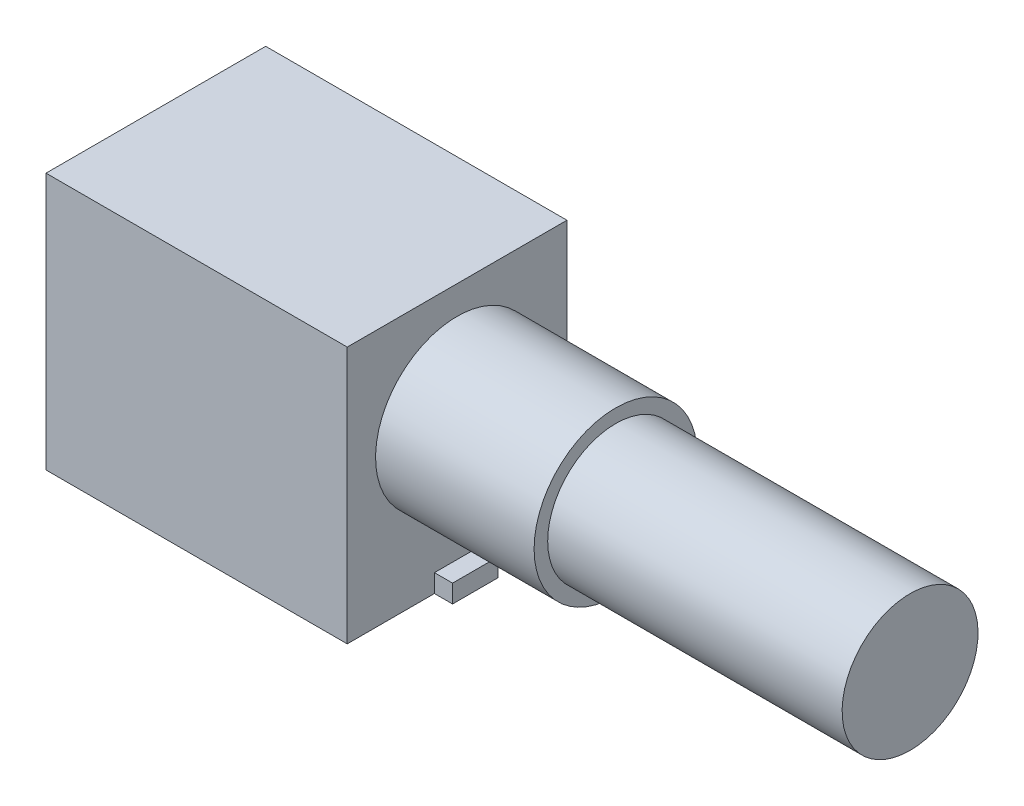
ISO-10303-21;
HEADER;
FILE_DESCRIPTION(('STEP AP214'),'2;1');
FILE_NAME('part.step','',(''),(''),'','','');
FILE_SCHEMA(('AUTOMOTIVE_DESIGN { 1 0 10303 214 1 1 1 1 }'));
ENDSEC;
DATA;
#1=APPLICATION_CONTEXT('core data for automotive mechanical design processes');
#2=APPLICATION_PROTOCOL_DEFINITION('international standard','automotive_design',2000,#1);
#3=PRODUCT_CONTEXT('',#1,'mechanical');
#4=PRODUCT('Part','Part','',(#3));
#5=PRODUCT_RELATED_PRODUCT_CATEGORY('part','',(#4));
#6=PRODUCT_DEFINITION_FORMATION('','',#4);
#7=PRODUCT_DEFINITION_CONTEXT('part definition',#1,'design');
#8=PRODUCT_DEFINITION('design','',#6,#7);
#9=PRODUCT_DEFINITION_SHAPE('','',#8);
#10=(LENGTH_UNIT() NAMED_UNIT(*) SI_UNIT(.MILLI.,.METRE.));
#11=(NAMED_UNIT(*) PLANE_ANGLE_UNIT() SI_UNIT($,.RADIAN.));
#12=(NAMED_UNIT(*) SI_UNIT($,.STERADIAN.) SOLID_ANGLE_UNIT());
#13=UNCERTAINTY_MEASURE_WITH_UNIT(LENGTH_MEASURE(1.E-05),#10,'distance_accuracy_value','');
#14=(GEOMETRIC_REPRESENTATION_CONTEXT(3) GLOBAL_UNCERTAINTY_ASSIGNED_CONTEXT((#13)) GLOBAL_UNIT_ASSIGNED_CONTEXT((#10,
#11,#12)) REPRESENTATION_CONTEXT('',''));
#15=CARTESIAN_POINT('',(0.,0.,0.));
#16=DIRECTION('',(0.,0.,1.));
#17=DIRECTION('',(1.,0.,0.));
#18=AXIS2_PLACEMENT_3D('',#15,#16,#17);
#19=CARTESIAN_POINT('',(13.3,0.,9.7));
#20=DIRECTION('',(-1.,0.,0.));
#21=DIRECTION('',(0.,-1.,0.));
#22=AXIS2_PLACEMENT_3D('',#19,#20,#21);
#23=PLANE('',#22);
#24=CARTESIAN_POINT('',(13.3,6.5,4.85));
#25=DIRECTION('',(-1.,0.,0.));
#26=DIRECTION('',(0.,-1.,0.));
#27=AXIS2_PLACEMENT_3D('',#24,#25,#26);
#28=CIRCLE('',#27,3.6);
#29=CARTESIAN_POINT('',(13.3,2.9,4.85));
#30=VERTEX_POINT('',#29);
#31=EDGE_CURVE('E12',#30,#30,#28,.F.);
#32=ORIENTED_EDGE('',*,*,#31,.F.);
#33=EDGE_LOOP('',(#32));
#34=FACE_BOUND('',#33,.T.);
#35=DIRECTION('',(0.,-1.,0.));
#36=VECTOR('',#35,1.);
#37=CARTESIAN_POINT('',(13.3,0.,5.85));
#38=LINE('',#37,#36);
#39=CARTESIAN_POINT('',(13.3,0.800000000000002,5.85));
#40=VERTEX_POINT('',#39);
#41=CARTESIAN_POINT('',(13.3,0.,5.85));
#42=VERTEX_POINT('',#41);
#43=EDGE_CURVE('E50',#40,#42,#38,.T.);
#44=ORIENTED_EDGE('',*,*,#43,.F.);
#45=DIRECTION('',(0.,0.,1.));
#46=VECTOR('',#45,1.);
#47=CARTESIAN_POINT('',(13.3,0.800000000000002,5.85));
#48=LINE('',#47,#46);
#49=CARTESIAN_POINT('',(13.3,0.800000000000002,3.85));
#50=VERTEX_POINT('',#49);
#51=EDGE_CURVE('E54',#50,#40,#48,.T.);
#52=ORIENTED_EDGE('',*,*,#51,.F.);
#53=DIRECTION('',(0.,1.,0.));
#54=VECTOR('',#53,1.);
#55=CARTESIAN_POINT('',(13.3,0.,3.85));
#56=LINE('',#55,#54);
#57=CARTESIAN_POINT('',(13.3,0.,3.85));
#58=VERTEX_POINT('',#57);
#59=EDGE_CURVE('E314',#58,#50,#56,.T.);
#60=ORIENTED_EDGE('',*,*,#59,.F.);
#61=DIRECTION('',(0.,0.,-1.));
#62=VECTOR('',#61,1.);
#63=CARTESIAN_POINT('',(13.3,0.,9.7));
#64=LINE('',#63,#62);
#65=CARTESIAN_POINT('',(13.3,0.,0.));
#66=VERTEX_POINT('',#65);
#67=EDGE_CURVE('E160',#58,#66,#64,.T.);
#68=ORIENTED_EDGE('',*,*,#67,.T.);
#69=DIRECTION('',(0.,1.,0.));
#70=VECTOR('',#69,1.);
#71=CARTESIAN_POINT('',(13.3,0.,0.));
#72=LINE('',#71,#70);
#73=CARTESIAN_POINT('',(13.3,11.35,0.));
#74=VERTEX_POINT('',#73);
#75=EDGE_CURVE('E152',#66,#74,#72,.T.);
#76=ORIENTED_EDGE('',*,*,#75,.T.);
#77=DIRECTION('',(0.,0.,-1.));
#78=VECTOR('',#77,1.);
#79=CARTESIAN_POINT('',(13.3,11.35,9.7));
#80=LINE('',#79,#78);
#81=CARTESIAN_POINT('',(13.3,11.35,9.7));
#82=VERTEX_POINT('',#81);
#83=EDGE_CURVE('E157',#82,#74,#80,.T.);
#84=ORIENTED_EDGE('',*,*,#83,.F.);
#85=DIRECTION('',(0.,1.,0.));
#86=VECTOR('',#85,1.);
#87=CARTESIAN_POINT('',(13.3,0.,9.7));
#88=LINE('',#87,#86);
#89=CARTESIAN_POINT('',(13.3,0.,9.7));
#90=VERTEX_POINT('',#89);
#91=EDGE_CURVE('E143',#90,#82,#88,.T.);
#92=ORIENTED_EDGE('',*,*,#91,.F.);
#93=EDGE_CURVE('E161',#90,#42,#64,.T.);
#94=ORIENTED_EDGE('',*,*,#93,.T.);
#95=EDGE_LOOP('',(#44,#52,#60,#68,#76,#84,#92,#94));
#96=FACE_BOUND('',#95,.T.);
#97=ADVANCED_FACE('F35',(#34,#96),#23,.F.);
#98=CARTESIAN_POINT('',(20.3,6.5,4.85));
#99=DIRECTION('',(1.,0.,0.));
#100=DIRECTION('',(0.,1.,0.));
#101=AXIS2_PLACEMENT_3D('',#98,#99,#100);
#102=PLANE('',#101);
#103=CARTESIAN_POINT('',(20.3,6.5,4.85));
#104=DIRECTION('',(1.,0.,0.));
#105=DIRECTION('',(0.,1.,0.));
#106=AXIS2_PLACEMENT_3D('',#103,#104,#105);
#107=CIRCLE('',#106,3.6);
#108=CARTESIAN_POINT('',(20.3,10.1,4.85));
#109=VERTEX_POINT('',#108);
#110=EDGE_CURVE('E133',#109,#109,#107,.T.);
#111=ORIENTED_EDGE('',*,*,#110,.T.);
#112=EDGE_LOOP('',(#111));
#113=FACE_BOUND('',#112,.T.);
#114=CARTESIAN_POINT('',(20.3,6.5,4.85));
#115=DIRECTION('',(1.,0.,0.));
#116=DIRECTION('',(0.,1.,0.));
#117=AXIS2_PLACEMENT_3D('',#114,#115,#116);
#118=CIRCLE('',#117,3.);
#119=CARTESIAN_POINT('',(20.3,9.5,4.85));
#120=VERTEX_POINT('',#119);
#121=EDGE_CURVE('E122',#120,#120,#118,.T.);
#122=ORIENTED_EDGE('',*,*,#121,.F.);
#123=EDGE_LOOP('',(#122));
#124=FACE_BOUND('',#123,.T.);
#125=ADVANCED_FACE('F190',(#113,#124),#102,.T.);
#126=CARTESIAN_POINT('',(0.,0.,9.7));
#127=DIRECTION('',(1.,0.,0.));
#128=DIRECTION('',(0.,0.,-1.));
#129=AXIS2_PLACEMENT_3D('',#126,#127,#128);
#130=PLANE('',#129);
#131=DIRECTION('',(0.,-1.,0.));
#132=VECTOR('',#131,1.);
#133=CARTESIAN_POINT('',(0.,0.,0.));
#134=LINE('',#133,#132);
#135=CARTESIAN_POINT('',(0.,11.35,0.));
#136=VERTEX_POINT('',#135);
#137=CARTESIAN_POINT('',(0.,0.,0.));
#138=VERTEX_POINT('',#137);
#139=EDGE_CURVE('E136',#136,#138,#134,.T.);
#140=ORIENTED_EDGE('',*,*,#139,.T.);
#141=DIRECTION('',(0.,0.,-1.));
#142=VECTOR('',#141,1.);
#143=CARTESIAN_POINT('',(0.,0.,9.7));
#144=LINE('',#143,#142);
#145=CARTESIAN_POINT('',(0.,0.,9.7));
#146=VERTEX_POINT('',#145);
#147=EDGE_CURVE('E43',#146,#138,#144,.T.);
#148=ORIENTED_EDGE('',*,*,#147,.F.);
#149=DIRECTION('',(0.,-1.,0.));
#150=VECTOR('',#149,1.);
#151=CARTESIAN_POINT('',(0.,0.,9.7));
#152=LINE('',#151,#150);
#153=CARTESIAN_POINT('',(0.,11.35,9.7));
#154=VERTEX_POINT('',#153);
#155=EDGE_CURVE('E137',#154,#146,#152,.T.);
#156=ORIENTED_EDGE('',*,*,#155,.F.);
#157=DIRECTION('',(0.,0.,-1.));
#158=VECTOR('',#157,1.);
#159=CARTESIAN_POINT('',(0.,11.35,9.7));
#160=LINE('',#159,#158);
#161=EDGE_CURVE('E147',#154,#136,#160,.T.);
#162=ORIENTED_EDGE('',*,*,#161,.T.);
#163=EDGE_LOOP('',(#140,#148,#156,#162));
#164=FACE_BOUND('',#163,.T.);
#165=ADVANCED_FACE('F37',(#164),#130,.F.);
#166=CARTESIAN_POINT('',(0.,0.,9.7));
#167=DIRECTION('',(0.,1.,0.));
#168=DIRECTION('',(0.,0.,1.));
#169=AXIS2_PLACEMENT_3D('',#166,#167,#168);
#170=PLANE('',#169);
#171=DIRECTION('',(1.,0.,0.));
#172=VECTOR('',#171,1.);
#173=CARTESIAN_POINT('',(0.,0.,0.));
#174=LINE('',#173,#172);
#175=EDGE_CURVE('E150',#138,#66,#174,.T.);
#176=ORIENTED_EDGE('',*,*,#175,.T.);
#177=ORIENTED_EDGE('',*,*,#67,.F.);
#178=DIRECTION('',(-1.,0.,0.));
#179=VECTOR('',#178,1.);
#180=CARTESIAN_POINT('',(14.1,0.,3.85));
#181=LINE('',#180,#179);
#182=CARTESIAN_POINT('',(14.1,0.,3.85));
#183=VERTEX_POINT('',#182);
#184=EDGE_CURVE('E107',#183,#58,#181,.T.);
#185=ORIENTED_EDGE('',*,*,#184,.F.);
#186=DIRECTION('',(0.,0.,-1.));
#187=VECTOR('',#186,1.);
#188=CARTESIAN_POINT('',(14.1,0.,5.85));
#189=LINE('',#188,#187);
#190=CARTESIAN_POINT('',(14.1,0.,5.85));
#191=VERTEX_POINT('',#190);
#192=EDGE_CURVE('E99',#191,#183,#189,.T.);
#193=ORIENTED_EDGE('',*,*,#192,.F.);
#194=DIRECTION('',(-1.,0.,0.));
#195=VECTOR('',#194,1.);
#196=CARTESIAN_POINT('',(14.1,0.,5.85));
#197=LINE('',#196,#195);
#198=EDGE_CURVE('E105',#191,#42,#197,.T.);
#199=ORIENTED_EDGE('',*,*,#198,.T.);
#200=ORIENTED_EDGE('',*,*,#93,.F.);
#201=DIRECTION('',(1.,0.,0.));
#202=VECTOR('',#201,1.);
#203=CARTESIAN_POINT('',(0.,0.,9.7));
#204=LINE('',#203,#202);
#205=EDGE_CURVE('E140',#146,#90,#204,.T.);
#206=ORIENTED_EDGE('',*,*,#205,.F.);
#207=ORIENTED_EDGE('',*,*,#147,.T.);
#208=EDGE_LOOP('',(#176,#177,#185,#193,#199,#200,#206,#207));
#209=FACE_BOUND('',#208,.T.);
#210=ADVANCED_FACE('F102',(#209),#170,.F.);
#211=CARTESIAN_POINT('',(0.,11.35,9.7));
#212=DIRECTION('',(0.,-1.,0.));
#213=DIRECTION('',(0.,0.,-1.));
#214=AXIS2_PLACEMENT_3D('',#211,#212,#213);
#215=PLANE('',#214);
#216=DIRECTION('',(-1.,0.,0.));
#217=VECTOR('',#216,1.);
#218=CARTESIAN_POINT('',(0.,11.35,0.));
#219=LINE('',#218,#217);
#220=EDGE_CURVE('E141',#74,#136,#219,.T.);
#221=ORIENTED_EDGE('',*,*,#220,.T.);
#222=ORIENTED_EDGE('',*,*,#161,.F.);
#223=DIRECTION('',(-1.,0.,0.));
#224=VECTOR('',#223,1.);
#225=CARTESIAN_POINT('',(0.,11.35,9.7));
#226=LINE('',#225,#224);
#227=EDGE_CURVE('E145',#82,#154,#226,.T.);
#228=ORIENTED_EDGE('',*,*,#227,.F.);
#229=ORIENTED_EDGE('',*,*,#83,.T.);
#230=EDGE_LOOP('',(#221,#222,#228,#229));
#231=FACE_BOUND('',#230,.T.);
#232=ADVANCED_FACE('F176',(#231),#215,.F.);
#233=CARTESIAN_POINT('',(0.,0.,9.7));
#234=DIRECTION('',(0.,0.,-1.));
#235=DIRECTION('',(-1.,0.,0.));
#236=AXIS2_PLACEMENT_3D('',#233,#234,#235);
#237=PLANE('',#236);
#238=ORIENTED_EDGE('',*,*,#155,.T.);
#239=ORIENTED_EDGE('',*,*,#205,.T.);
#240=ORIENTED_EDGE('',*,*,#91,.T.);
#241=ORIENTED_EDGE('',*,*,#227,.T.);
#242=EDGE_LOOP('',(#238,#239,#240,#241));
#243=FACE_BOUND('',#242,.T.);
#244=ADVANCED_FACE('F178',(#243),#237,.F.);
#245=CARTESIAN_POINT('',(0.,0.,0.));
#246=DIRECTION('',(0.,0.,-1.));
#247=DIRECTION('',(-1.,0.,0.));
#248=AXIS2_PLACEMENT_3D('',#245,#246,#247);
#249=PLANE('',#248);
#250=ORIENTED_EDGE('',*,*,#139,.F.);
#251=ORIENTED_EDGE('',*,*,#220,.F.);
#252=ORIENTED_EDGE('',*,*,#75,.F.);
#253=ORIENTED_EDGE('',*,*,#175,.F.);
#254=EDGE_LOOP('',(#250,#251,#252,#253));
#255=FACE_BOUND('',#254,.T.);
#256=ADVANCED_FACE('F171',(#255),#249,.T.);
#257=CARTESIAN_POINT('',(20.3,6.5,4.85));
#258=DIRECTION('',(-1.,0.,0.));
#259=DIRECTION('',(0.,-1.,0.));
#260=AXIS2_PLACEMENT_3D('',#257,#258,#259);
#261=CYLINDRICAL_SURFACE('',#260,3.6);
#262=ORIENTED_EDGE('',*,*,#110,.F.);
#263=EDGE_LOOP('',(#262));
#264=FACE_BOUND('',#263,.T.);
#265=ORIENTED_EDGE('',*,*,#31,.T.);
#266=EDGE_LOOP('',(#265));
#267=FACE_BOUND('',#266,.T.);
#268=ADVANCED_FACE('F185',(#264,#267),#261,.T.);
#269=CARTESIAN_POINT('',(61.7852813742386,6.50000000000001,4.85));
#270=DIRECTION('',(-1.,0.,0.));
#271=DIRECTION('',(0.,-1.,0.));
#272=AXIS2_PLACEMENT_3D('',#269,#270,#271);
#273=CYLINDRICAL_SURFACE('',#272,3.);
#274=CARTESIAN_POINT('',(33.3,6.5,4.85));
#275=DIRECTION('',(-1.,0.,0.));
#276=DIRECTION('',(0.,-1.,0.));
#277=AXIS2_PLACEMENT_3D('',#274,#275,#276);
#278=CIRCLE('',#277,3.);
#279=CARTESIAN_POINT('',(33.3,3.5,4.85));
#280=VERTEX_POINT('',#279);
#281=EDGE_CURVE('E125',#280,#280,#278,.T.);
#282=ORIENTED_EDGE('',*,*,#281,.T.);
#283=EDGE_LOOP('',(#282));
#284=FACE_BOUND('',#283,.T.);
#285=ORIENTED_EDGE('',*,*,#121,.T.);
#286=EDGE_LOOP('',(#285));
#287=FACE_BOUND('',#286,.T.);
#288=ADVANCED_FACE('F221',(#284,#287),#273,.T.);
#289=CARTESIAN_POINT('',(33.3,0.,9.7));
#290=DIRECTION('',(-1.,0.,0.));
#291=DIRECTION('',(0.,-1.,0.));
#292=AXIS2_PLACEMENT_3D('',#289,#290,#291);
#293=PLANE('',#292);
#294=ORIENTED_EDGE('',*,*,#281,.F.);
#295=EDGE_LOOP('',(#294));
#296=FACE_BOUND('',#295,.T.);
#297=ADVANCED_FACE('F225',(#296),#293,.F.);
#298=CARTESIAN_POINT('',(14.1,0.,5.85));
#299=DIRECTION('',(0.,0.,-1.));
#300=DIRECTION('',(-1.,0.,0.));
#301=AXIS2_PLACEMENT_3D('',#298,#299,#300);
#302=PLANE('',#301);
#303=ORIENTED_EDGE('',*,*,#43,.T.);
#304=ORIENTED_EDGE('',*,*,#198,.F.);
#305=DIRECTION('',(0.,-1.,0.));
#306=VECTOR('',#305,1.);
#307=CARTESIAN_POINT('',(14.1,0.,5.85));
#308=LINE('',#307,#306);
#309=CARTESIAN_POINT('',(14.1,0.800000000000002,5.85));
#310=VERTEX_POINT('',#309);
#311=EDGE_CURVE('E111',#310,#191,#308,.T.);
#312=ORIENTED_EDGE('',*,*,#311,.F.);
#313=DIRECTION('',(-1.,0.,0.));
#314=VECTOR('',#313,1.);
#315=CARTESIAN_POINT('',(14.1,0.800000000000002,5.85));
#316=LINE('',#315,#314);
#317=EDGE_CURVE('E312',#310,#40,#316,.T.);
#318=ORIENTED_EDGE('',*,*,#317,.T.);
#319=EDGE_LOOP('',(#303,#304,#312,#318));
#320=FACE_BOUND('',#319,.T.);
#321=ADVANCED_FACE('F121',(#320),#302,.F.);
#322=CARTESIAN_POINT('',(14.1,0.,3.85));
#323=DIRECTION('',(0.,0.,1.));
#324=DIRECTION('',(1.,0.,0.));
#325=AXIS2_PLACEMENT_3D('',#322,#323,#324);
#326=PLANE('',#325);
#327=ORIENTED_EDGE('',*,*,#59,.T.);
#328=DIRECTION('',(-1.,0.,0.));
#329=VECTOR('',#328,1.);
#330=CARTESIAN_POINT('',(14.1,0.800000000000002,3.85));
#331=LINE('',#330,#329);
#332=CARTESIAN_POINT('',(14.1,0.800000000000002,3.85));
#333=VERTEX_POINT('',#332);
#334=EDGE_CURVE('E127',#333,#50,#331,.T.);
#335=ORIENTED_EDGE('',*,*,#334,.F.);
#336=DIRECTION('',(0.,1.,0.));
#337=VECTOR('',#336,1.);
#338=CARTESIAN_POINT('',(14.1,0.,3.85));
#339=LINE('',#338,#337);
#340=EDGE_CURVE('E110',#183,#333,#339,.T.);
#341=ORIENTED_EDGE('',*,*,#340,.F.);
#342=ORIENTED_EDGE('',*,*,#184,.T.);
#343=EDGE_LOOP('',(#327,#335,#341,#342));
#344=FACE_BOUND('',#343,.T.);
#345=ADVANCED_FACE('F253',(#344),#326,.F.);
#346=CARTESIAN_POINT('',(14.1,0.800000000000002,5.85));
#347=DIRECTION('',(0.,-1.,0.));
#348=DIRECTION('',(1.,0.,0.));
#349=AXIS2_PLACEMENT_3D('',#346,#347,#348);
#350=PLANE('',#349);
#351=ORIENTED_EDGE('',*,*,#51,.T.);
#352=ORIENTED_EDGE('',*,*,#317,.F.);
#353=DIRECTION('',(0.,0.,1.));
#354=VECTOR('',#353,1.);
#355=CARTESIAN_POINT('',(14.1,0.800000000000002,5.85));
#356=LINE('',#355,#354);
#357=EDGE_CURVE('E116',#333,#310,#356,.T.);
#358=ORIENTED_EDGE('',*,*,#357,.F.);
#359=ORIENTED_EDGE('',*,*,#334,.T.);
#360=EDGE_LOOP('',(#351,#352,#358,#359));
#361=FACE_BOUND('',#360,.T.);
#362=ADVANCED_FACE('F262',(#361),#350,.F.);
#363=CARTESIAN_POINT('',(14.1,0.,0.));
#364=DIRECTION('',(-1.,0.,0.));
#365=DIRECTION('',(0.,0.,1.));
#366=AXIS2_PLACEMENT_3D('',#363,#364,#365);
#367=PLANE('',#366);
#368=ORIENTED_EDGE('',*,*,#311,.T.);
#369=ORIENTED_EDGE('',*,*,#192,.T.);
#370=ORIENTED_EDGE('',*,*,#340,.T.);
#371=ORIENTED_EDGE('',*,*,#357,.T.);
#372=EDGE_LOOP('',(#368,#369,#370,#371));
#373=FACE_BOUND('',#372,.T.);
#374=ADVANCED_FACE('F114',(#373),#367,.F.);
#375=CLOSED_SHELL('',(#97,#125,#165,#210,#232,#244,#256,#268,#288,#297,#321,#345,#362,#374));
#376=MANIFOLD_SOLID_BREP('B2',#375);
#377=ADVANCED_BREP_SHAPE_REPRESENTATION('',(#18,#376),#14);
#378=SHAPE_DEFINITION_REPRESENTATION(#9,#377);
ENDSEC;
END-ISO-10303-21;
